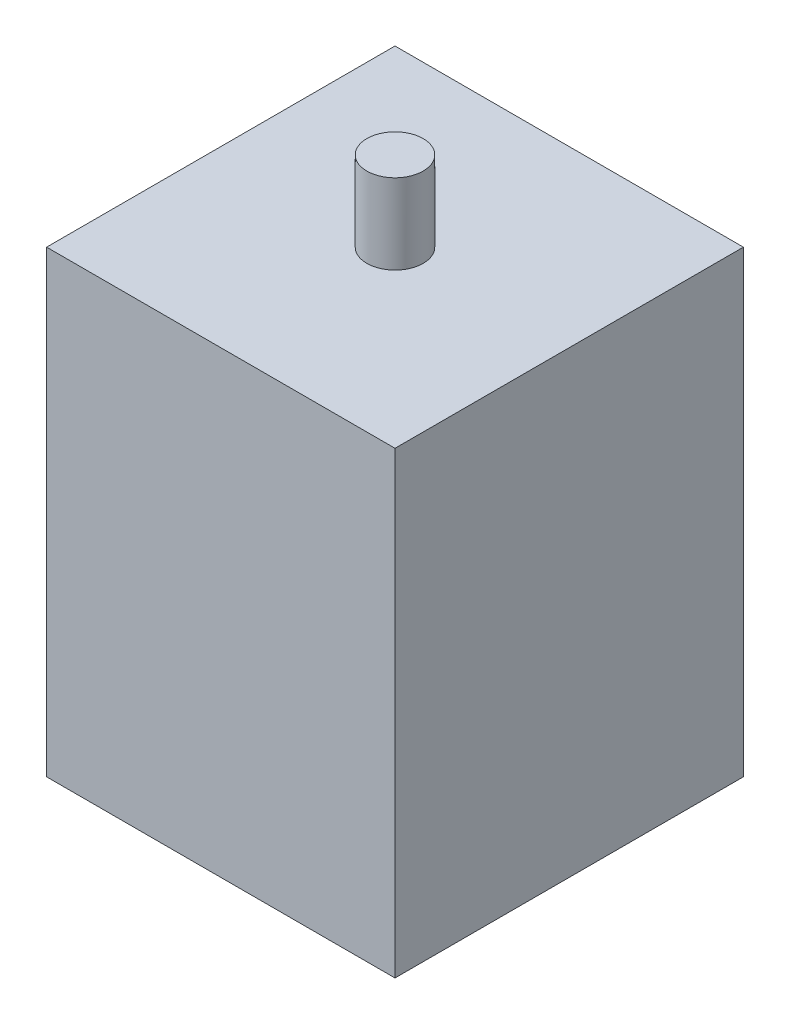
ISO-10303-21;
HEADER;
FILE_DESCRIPTION(('STEP AP214'),'2;1');
FILE_NAME('part.step','',(''),(''),'','','');
FILE_SCHEMA(('AUTOMOTIVE_DESIGN { 1 0 10303 214 1 1 1 1 }'));
ENDSEC;
DATA;
#1=APPLICATION_CONTEXT('core data for automotive mechanical design processes');
#2=APPLICATION_PROTOCOL_DEFINITION('international standard','automotive_design',2000,#1);
#3=PRODUCT_CONTEXT('',#1,'mechanical');
#4=PRODUCT('Part','Part','',(#3));
#5=PRODUCT_RELATED_PRODUCT_CATEGORY('part','',(#4));
#6=PRODUCT_DEFINITION_FORMATION('','',#4);
#7=PRODUCT_DEFINITION_CONTEXT('part definition',#1,'design');
#8=PRODUCT_DEFINITION('design','',#6,#7);
#9=PRODUCT_DEFINITION_SHAPE('','',#8);
#10=(LENGTH_UNIT() NAMED_UNIT(*) SI_UNIT(.MILLI.,.METRE.));
#11=(NAMED_UNIT(*) PLANE_ANGLE_UNIT() SI_UNIT($,.RADIAN.));
#12=(NAMED_UNIT(*) SI_UNIT($,.STERADIAN.) SOLID_ANGLE_UNIT());
#13=UNCERTAINTY_MEASURE_WITH_UNIT(LENGTH_MEASURE(1.E-05),#10,'distance_accuracy_value','');
#14=(GEOMETRIC_REPRESENTATION_CONTEXT(3) GLOBAL_UNCERTAINTY_ASSIGNED_CONTEXT((#13)) GLOBAL_UNIT_ASSIGNED_CONTEXT((#10,
#11,#12)) REPRESENTATION_CONTEXT('',''));
#15=CARTESIAN_POINT('',(0.,0.,0.));
#16=DIRECTION('',(0.,0.,1.));
#17=DIRECTION('',(1.,0.,0.));
#18=AXIS2_PLACEMENT_3D('',#15,#16,#17);
#19=CARTESIAN_POINT('',(0.,122.2,0.));
#20=DIRECTION('',(1.,0.,0.));
#21=DIRECTION('',(0.,0.,-1.));
#22=AXIS2_PLACEMENT_3D('',#19,#20,#21);
#23=PLANE('',#22);
#24=DIRECTION('',(0.,0.,1.));
#25=VECTOR('',#24,1.);
#26=CARTESIAN_POINT('',(0.,0.,0.));
#27=LINE('',#26,#25);
#28=CARTESIAN_POINT('',(0.,0.,-92.8));
#29=VERTEX_POINT('',#28);
#30=CARTESIAN_POINT('',(0.,0.,0.));
#31=VERTEX_POINT('',#30);
#32=EDGE_CURVE('E115',#29,#31,#27,.T.);
#33=ORIENTED_EDGE('',*,*,#32,.T.);
#34=DIRECTION('',(0.,-1.,0.));
#35=VECTOR('',#34,1.);
#36=CARTESIAN_POINT('',(0.,122.2,0.));
#37=LINE('',#36,#35);
#38=CARTESIAN_POINT('',(0.,122.2,0.));
#39=VERTEX_POINT('',#38);
#40=EDGE_CURVE('E57',#39,#31,#37,.T.);
#41=ORIENTED_EDGE('',*,*,#40,.F.);
#42=DIRECTION('',(0.,0.,1.));
#43=VECTOR('',#42,1.);
#44=CARTESIAN_POINT('',(0.,122.2,0.));
#45=LINE('',#44,#43);
#46=CARTESIAN_POINT('',(0.,122.2,-92.8));
#47=VERTEX_POINT('',#46);
#48=EDGE_CURVE('E101',#47,#39,#45,.T.);
#49=ORIENTED_EDGE('',*,*,#48,.F.);
#50=DIRECTION('',(0.,-1.,0.));
#51=VECTOR('',#50,1.);
#52=CARTESIAN_POINT('',(0.,122.2,-92.8));
#53=LINE('',#52,#51);
#54=EDGE_CURVE('E111',#47,#29,#53,.T.);
#55=ORIENTED_EDGE('',*,*,#54,.T.);
#56=EDGE_LOOP('',(#33,#41,#49,#55));
#57=FACE_BOUND('',#56,.T.);
#58=ADVANCED_FACE('F49',(#57),#23,.F.);
#59=CARTESIAN_POINT('',(0.,122.2,0.));
#60=DIRECTION('',(0.,0.,-1.));
#61=DIRECTION('',(-1.,0.,0.));
#62=AXIS2_PLACEMENT_3D('',#59,#60,#61);
#63=PLANE('',#62);
#64=DIRECTION('',(1.,0.,0.));
#65=VECTOR('',#64,1.);
#66=CARTESIAN_POINT('',(0.,0.,0.));
#67=LINE('',#66,#65);
#68=CARTESIAN_POINT('',(92.8,0.,0.));
#69=VERTEX_POINT('',#68);
#70=EDGE_CURVE('E106',#31,#69,#67,.T.);
#71=ORIENTED_EDGE('',*,*,#70,.T.);
#72=DIRECTION('',(0.,-1.,0.));
#73=VECTOR('',#72,1.);
#74=CARTESIAN_POINT('',(92.8,122.2,0.));
#75=LINE('',#74,#73);
#76=CARTESIAN_POINT('',(92.8,122.2,0.));
#77=VERTEX_POINT('',#76);
#78=EDGE_CURVE('E104',#77,#69,#75,.T.);
#79=ORIENTED_EDGE('',*,*,#78,.F.);
#80=DIRECTION('',(1.,0.,0.));
#81=VECTOR('',#80,1.);
#82=CARTESIAN_POINT('',(0.,122.2,0.));
#83=LINE('',#82,#81);
#84=EDGE_CURVE('E96',#39,#77,#83,.T.);
#85=ORIENTED_EDGE('',*,*,#84,.F.);
#86=ORIENTED_EDGE('',*,*,#40,.T.);
#87=EDGE_LOOP('',(#71,#79,#85,#86));
#88=FACE_BOUND('',#87,.T.);
#89=ADVANCED_FACE('F105',(#88),#63,.F.);
#90=CARTESIAN_POINT('',(92.8,122.2,0.));
#91=DIRECTION('',(-1.,0.,0.));
#92=DIRECTION('',(0.,0.,1.));
#93=AXIS2_PLACEMENT_3D('',#90,#91,#92);
#94=PLANE('',#93);
#95=DIRECTION('',(0.,0.,-1.));
#96=VECTOR('',#95,1.);
#97=CARTESIAN_POINT('',(92.8,0.,0.));
#98=LINE('',#97,#96);
#99=CARTESIAN_POINT('',(92.8,0.,-92.8));
#100=VERTEX_POINT('',#99);
#101=EDGE_CURVE('E82',#69,#100,#98,.T.);
#102=ORIENTED_EDGE('',*,*,#101,.T.);
#103=DIRECTION('',(0.,-1.,0.));
#104=VECTOR('',#103,1.);
#105=CARTESIAN_POINT('',(92.8,122.2,-92.8));
#106=LINE('',#105,#104);
#107=CARTESIAN_POINT('',(92.8,122.2,-92.8));
#108=VERTEX_POINT('',#107);
#109=EDGE_CURVE('E107',#108,#100,#106,.T.);
#110=ORIENTED_EDGE('',*,*,#109,.F.);
#111=DIRECTION('',(0.,0.,-1.));
#112=VECTOR('',#111,1.);
#113=CARTESIAN_POINT('',(92.8,122.2,0.));
#114=LINE('',#113,#112);
#115=EDGE_CURVE('E99',#77,#108,#114,.T.);
#116=ORIENTED_EDGE('',*,*,#115,.F.);
#117=ORIENTED_EDGE('',*,*,#78,.T.);
#118=EDGE_LOOP('',(#102,#110,#116,#117));
#119=FACE_BOUND('',#118,.T.);
#120=ADVANCED_FACE('F109',(#119),#94,.F.);
#121=CARTESIAN_POINT('',(0.,122.2,-92.8));
#122=DIRECTION('',(0.,0.,1.));
#123=DIRECTION('',(1.,0.,0.));
#124=AXIS2_PLACEMENT_3D('',#121,#122,#123);
#125=PLANE('',#124);
#126=DIRECTION('',(-1.,0.,0.));
#127=VECTOR('',#126,1.);
#128=CARTESIAN_POINT('',(0.,0.,-92.8));
#129=LINE('',#128,#127);
#130=EDGE_CURVE('E88',#100,#29,#129,.T.);
#131=ORIENTED_EDGE('',*,*,#130,.T.);
#132=ORIENTED_EDGE('',*,*,#54,.F.);
#133=DIRECTION('',(-1.,0.,0.));
#134=VECTOR('',#133,1.);
#135=CARTESIAN_POINT('',(0.,122.2,-92.8));
#136=LINE('',#135,#134);
#137=EDGE_CURVE('E65',#108,#47,#136,.T.);
#138=ORIENTED_EDGE('',*,*,#137,.F.);
#139=ORIENTED_EDGE('',*,*,#109,.T.);
#140=EDGE_LOOP('',(#131,#132,#138,#139));
#141=FACE_BOUND('',#140,.T.);
#142=ADVANCED_FACE('F138',(#141),#125,.F.);
#143=CARTESIAN_POINT('',(0.,122.2,0.));
#144=DIRECTION('',(0.,-1.,0.));
#145=DIRECTION('',(0.,0.,-1.));
#146=AXIS2_PLACEMENT_3D('',#143,#144,#145);
#147=PLANE('',#146);
#148=CARTESIAN_POINT('',(46.4,122.2,-46.4));
#149=DIRECTION('',(0.,-1.,0.));
#150=DIRECTION('',(0.,0.,-1.));
#151=AXIS2_PLACEMENT_3D('',#148,#149,#150);
#152=CIRCLE('',#151,7.5);
#153=CARTESIAN_POINT('',(46.4,122.2,-53.9));
#154=VERTEX_POINT('',#153);
#155=EDGE_CURVE('E11',#154,#154,#152,.F.);
#156=ORIENTED_EDGE('',*,*,#155,.F.);
#157=EDGE_LOOP('',(#156));
#158=FACE_BOUND('',#157,.T.);
#159=ORIENTED_EDGE('',*,*,#48,.T.);
#160=ORIENTED_EDGE('',*,*,#84,.T.);
#161=ORIENTED_EDGE('',*,*,#115,.T.);
#162=ORIENTED_EDGE('',*,*,#137,.T.);
#163=EDGE_LOOP('',(#159,#160,#161,#162));
#164=FACE_BOUND('',#163,.T.);
#165=ADVANCED_FACE('F97',(#158,#164),#147,.F.);
#166=CARTESIAN_POINT('',(0.,0.,0.));
#167=DIRECTION('',(0.,-1.,0.));
#168=DIRECTION('',(0.,0.,-1.));
#169=AXIS2_PLACEMENT_3D('',#166,#167,#168);
#170=PLANE('',#169);
#171=ORIENTED_EDGE('',*,*,#32,.F.);
#172=ORIENTED_EDGE('',*,*,#130,.F.);
#173=ORIENTED_EDGE('',*,*,#101,.F.);
#174=ORIENTED_EDGE('',*,*,#70,.F.);
#175=EDGE_LOOP('',(#171,#172,#173,#174));
#176=FACE_BOUND('',#175,.T.);
#177=ADVANCED_FACE('F126',(#176),#170,.T.);
#178=CARTESIAN_POINT('',(46.4,143.5,-46.4));
#179=DIRECTION('',(0.,-1.,0.));
#180=DIRECTION('',(0.,0.,-1.));
#181=AXIS2_PLACEMENT_3D('',#178,#179,#180);
#182=CYLINDRICAL_SURFACE('',#181,7.5);
#183=CARTESIAN_POINT('',(46.4,143.5,-46.4));
#184=DIRECTION('',(0.,1.,0.));
#185=DIRECTION('',(0.,0.,1.));
#186=AXIS2_PLACEMENT_3D('',#183,#184,#185);
#187=CIRCLE('',#186,7.5);
#188=CARTESIAN_POINT('',(46.4,143.5,-38.9));
#189=VERTEX_POINT('',#188);
#190=EDGE_CURVE('E118',#189,#189,#187,.T.);
#191=ORIENTED_EDGE('',*,*,#190,.F.);
#192=EDGE_LOOP('',(#191));
#193=FACE_BOUND('',#192,.T.);
#194=ORIENTED_EDGE('',*,*,#155,.T.);
#195=EDGE_LOOP('',(#194));
#196=FACE_BOUND('',#195,.T.);
#197=ADVANCED_FACE('F128',(#193,#196),#182,.T.);
#198=CARTESIAN_POINT('',(46.4,143.5,-46.4));
#199=DIRECTION('',(0.,1.,0.));
#200=DIRECTION('',(0.,0.,1.));
#201=AXIS2_PLACEMENT_3D('',#198,#199,#200);
#202=PLANE('',#201);
#203=ORIENTED_EDGE('',*,*,#190,.T.);
#204=EDGE_LOOP('',(#203));
#205=FACE_BOUND('',#204,.T.);
#206=ADVANCED_FACE('F135',(#205),#202,.T.);
#207=CLOSED_SHELL('',(#58,#89,#120,#142,#165,#177,#197,#206));
#208=MANIFOLD_SOLID_BREP('B2',#207);
#209=ADVANCED_BREP_SHAPE_REPRESENTATION('',(#18,#208),#14);
#210=SHAPE_DEFINITION_REPRESENTATION(#9,#209);
ENDSEC;
END-ISO-10303-21;
